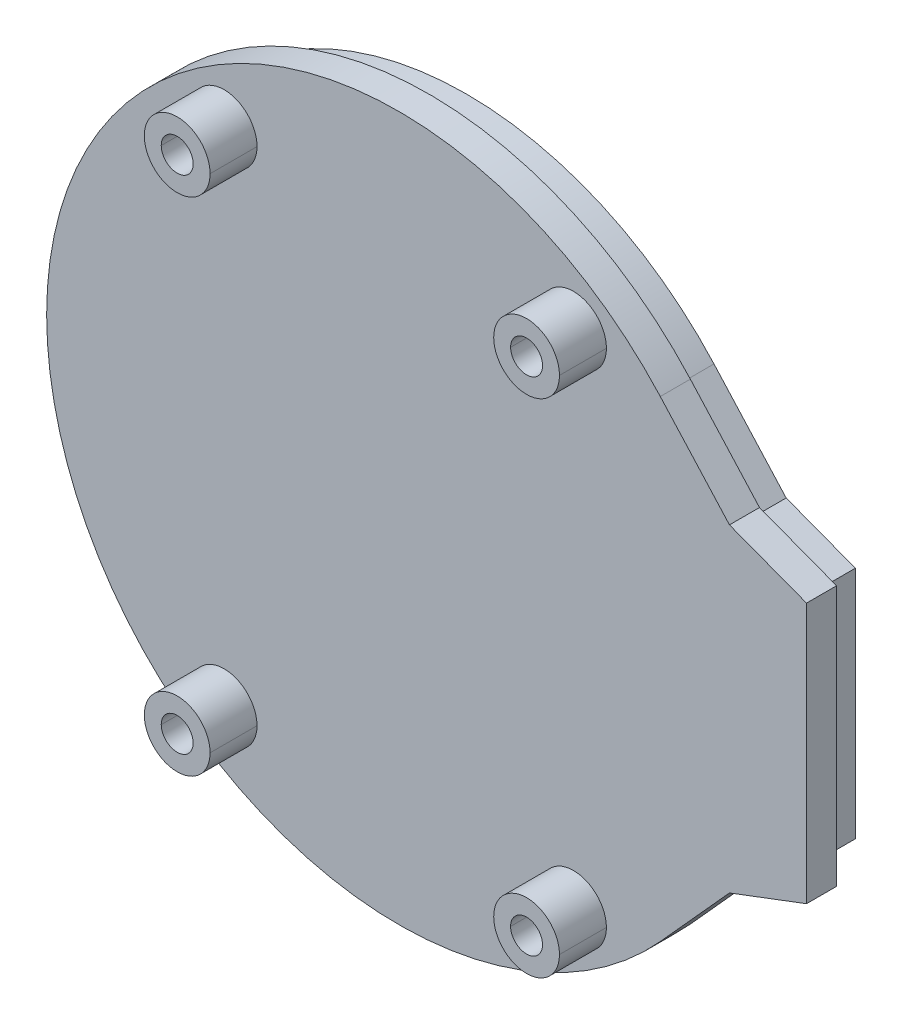
ISO-10303-21;
HEADER;
FILE_DESCRIPTION(('STEP AP214'),'2;1');
FILE_NAME('part.step','',(''),(''),'','','');
FILE_SCHEMA(('AUTOMOTIVE_DESIGN { 1 0 10303 214 1 1 1 1 }'));
ENDSEC;
DATA;
#1=APPLICATION_CONTEXT('core data for automotive mechanical design processes');
#2=APPLICATION_PROTOCOL_DEFINITION('international standard','automotive_design',2000,#1);
#3=PRODUCT_CONTEXT('',#1,'mechanical');
#4=PRODUCT('Part','Part','',(#3));
#5=PRODUCT_RELATED_PRODUCT_CATEGORY('part','',(#4));
#6=PRODUCT_DEFINITION_FORMATION('','',#4);
#7=PRODUCT_DEFINITION_CONTEXT('part definition',#1,'design');
#8=PRODUCT_DEFINITION('design','',#6,#7);
#9=PRODUCT_DEFINITION_SHAPE('','',#8);
#10=(LENGTH_UNIT() NAMED_UNIT(*) SI_UNIT(.MILLI.,.METRE.));
#11=(NAMED_UNIT(*) PLANE_ANGLE_UNIT() SI_UNIT($,.RADIAN.));
#12=(NAMED_UNIT(*) SI_UNIT($,.STERADIAN.) SOLID_ANGLE_UNIT());
#13=UNCERTAINTY_MEASURE_WITH_UNIT(LENGTH_MEASURE(1.E-05),#10,'distance_accuracy_value','');
#14=(GEOMETRIC_REPRESENTATION_CONTEXT(3) GLOBAL_UNCERTAINTY_ASSIGNED_CONTEXT((#13)) GLOBAL_UNIT_ASSIGNED_CONTEXT((#10,
#11,#12)) REPRESENTATION_CONTEXT('',''));
#15=CARTESIAN_POINT('',(0.,0.,0.));
#16=DIRECTION('',(0.,0.,1.));
#17=DIRECTION('',(1.,0.,0.));
#18=AXIS2_PLACEMENT_3D('',#15,#16,#17);
#19=CARTESIAN_POINT('',(13.91896407731,12.56283960793,-1.15));
#20=DIRECTION('',(0.742344750789687,0.670018112423088,0.));
#21=DIRECTION('',(0.,0.,-1.));
#22=AXIS2_PLACEMENT_3D('',#19,#20,#21);
#23=PLANE('',#22);
#24=DIRECTION('',(0.670018112423088,-0.742344750789687,0.));
#25=VECTOR('',#24,1.);
#26=CARTESIAN_POINT('',(13.91896407731,12.56283960793,0.45));
#27=LINE('',#26,#25);
#28=CARTESIAN_POINT('',(13.91896407731,12.56283960793,0.45));
#29=VERTEX_POINT('',#28);
#30=CARTESIAN_POINT('',(17.6,8.484445839148,0.45));
#31=VERTEX_POINT('',#30);
#32=EDGE_CURVE('E330',#29,#31,#27,.T.);
#33=ORIENTED_EDGE('',*,*,#32,.T.);
#34=DIRECTION('',(0.,0.,-1.));
#35=VECTOR('',#34,1.);
#36=CARTESIAN_POINT('',(17.6,8.484445839148,0.45));
#37=LINE('',#36,#35);
#38=CARTESIAN_POINT('',(17.6,8.484445839148,-1.15));
#39=VERTEX_POINT('',#38);
#40=EDGE_CURVE('E11',#31,#39,#37,.T.);
#41=ORIENTED_EDGE('',*,*,#40,.T.);
#42=DIRECTION('',(0.670018112423088,-0.742344750789687,0.));
#43=VECTOR('',#42,1.);
#44=CARTESIAN_POINT('',(13.91896407731,12.56283960793,-1.15));
#45=LINE('',#44,#43);
#46=CARTESIAN_POINT('',(13.91896407731,12.56283960793,-1.15));
#47=VERTEX_POINT('',#46);
#48=EDGE_CURVE('E390',#47,#39,#45,.T.);
#49=ORIENTED_EDGE('',*,*,#48,.F.);
#50=DIRECTION('',(0.,0.,1.));
#51=VECTOR('',#50,1.);
#52=CARTESIAN_POINT('',(13.91896407731,12.56283960793,-1.15));
#53=LINE('',#52,#51);
#54=EDGE_CURVE('E494',#47,#29,#53,.T.);
#55=ORIENTED_EDGE('',*,*,#54,.T.);
#56=EDGE_LOOP('',(#33,#41,#49,#55));
#57=FACE_BOUND('',#56,.T.);
#58=ADVANCED_FACE('F37',(#57),#23,.T.);
#59=CARTESIAN_POINT('',(16.50310576831,8.9,-1.15));
#60=DIRECTION('',(0.354274719657485,0.93514139198926,0.));
#61=DIRECTION('',(0.,0.,-1.));
#62=AXIS2_PLACEMENT_3D('',#59,#60,#61);
#63=PLANE('',#62);
#64=DIRECTION('',(0.93514139198926,-0.354274719657485,0.));
#65=VECTOR('',#64,1.);
#66=CARTESIAN_POINT('',(17.6,8.484445839148,0.45));
#67=LINE('',#66,#65);
#68=CARTESIAN_POINT('',(21.70310576831,6.93,0.45));
#69=VERTEX_POINT('',#68);
#70=EDGE_CURVE('E334',#31,#69,#67,.T.);
#71=ORIENTED_EDGE('',*,*,#70,.T.);
#72=DIRECTION('',(0.,0.,1.));
#73=VECTOR('',#72,1.);
#74=CARTESIAN_POINT('',(21.70310576831,6.93,-1.15));
#75=LINE('',#74,#73);
#76=CARTESIAN_POINT('',(21.70310576831,6.93,-1.15));
#77=VERTEX_POINT('',#76);
#78=EDGE_CURVE('E527',#77,#69,#75,.T.);
#79=ORIENTED_EDGE('',*,*,#78,.F.);
#80=DIRECTION('',(0.93514139198926,-0.354274719657485,0.));
#81=VECTOR('',#80,1.);
#82=CARTESIAN_POINT('',(17.6,8.484445839148,-1.15));
#83=LINE('',#82,#81);
#84=EDGE_CURVE('E392',#39,#77,#83,.T.);
#85=ORIENTED_EDGE('',*,*,#84,.F.);
#86=ORIENTED_EDGE('',*,*,#40,.F.);
#87=EDGE_LOOP('',(#71,#79,#85,#86));
#88=FACE_BOUND('',#87,.T.);
#89=ADVANCED_FACE('F653',(#88),#63,.T.);
#90=CARTESIAN_POINT('',(16.50310576831,-8.9,-1.15));
#91=DIRECTION('',(-0.354274719657485,0.93514139198926,0.));
#92=DIRECTION('',(0.,0.,1.));
#93=AXIS2_PLACEMENT_3D('',#90,#91,#92);
#94=PLANE('',#93);
#95=DIRECTION('',(0.93514139198926,0.354274719657485,0.));
#96=VECTOR('',#95,1.);
#97=CARTESIAN_POINT('',(17.6,-8.484445839148,-1.15));
#98=LINE('',#97,#96);
#99=CARTESIAN_POINT('',(17.6,-8.484445839148,-1.15));
#100=VERTEX_POINT('',#99);
#101=CARTESIAN_POINT('',(21.70310576831,-6.93,-1.15));
#102=VERTEX_POINT('',#101);
#103=EDGE_CURVE('E395',#100,#102,#98,.T.);
#104=ORIENTED_EDGE('',*,*,#103,.T.);
#105=DIRECTION('',(0.,0.,1.));
#106=VECTOR('',#105,1.);
#107=CARTESIAN_POINT('',(21.70310576831,-6.93,-1.15));
#108=LINE('',#107,#106);
#109=CARTESIAN_POINT('',(21.70310576831,-6.93,0.45));
#110=VERTEX_POINT('',#109);
#111=EDGE_CURVE('E391',#102,#110,#108,.T.);
#112=ORIENTED_EDGE('',*,*,#111,.T.);
#113=DIRECTION('',(0.93514139198926,0.354274719657485,0.));
#114=VECTOR('',#113,1.);
#115=CARTESIAN_POINT('',(17.6,-8.484445839148,0.45));
#116=LINE('',#115,#114);
#117=CARTESIAN_POINT('',(17.6,-8.484445839148,0.45));
#118=VERTEX_POINT('',#117);
#119=EDGE_CURVE('E410',#118,#110,#116,.T.);
#120=ORIENTED_EDGE('',*,*,#119,.F.);
#121=DIRECTION('',(0.,0.,-1.));
#122=VECTOR('',#121,1.);
#123=CARTESIAN_POINT('',(17.6,-8.484445839148,0.45));
#124=LINE('',#123,#122);
#125=EDGE_CURVE('E48',#118,#100,#124,.T.);
#126=ORIENTED_EDGE('',*,*,#125,.T.);
#127=EDGE_LOOP('',(#104,#112,#120,#126));
#128=FACE_BOUND('',#127,.T.);
#129=ADVANCED_FACE('F661',(#128),#94,.F.);
#130=CARTESIAN_POINT('',(13.91896407731,-12.56283960793,-1.15));
#131=DIRECTION('',(-0.742344750789687,0.670018112423088,0.));
#132=DIRECTION('',(0.,0.,1.));
#133=AXIS2_PLACEMENT_3D('',#130,#131,#132);
#134=PLANE('',#133);
#135=DIRECTION('',(0.670018112423088,0.742344750789687,0.));
#136=VECTOR('',#135,1.);
#137=CARTESIAN_POINT('',(13.91896407731,-12.56283960793,-1.15));
#138=LINE('',#137,#136);
#139=CARTESIAN_POINT('',(13.91896407731,-12.56283960793,-1.15));
#140=VERTEX_POINT('',#139);
#141=EDGE_CURVE('E434',#140,#100,#138,.T.);
#142=ORIENTED_EDGE('',*,*,#141,.T.);
#143=ORIENTED_EDGE('',*,*,#125,.F.);
#144=DIRECTION('',(0.670018112423088,0.742344750789687,0.));
#145=VECTOR('',#144,1.);
#146=CARTESIAN_POINT('',(13.91896407731,-12.56283960793,0.45));
#147=LINE('',#146,#145);
#148=CARTESIAN_POINT('',(13.91896407731,-12.56283960793,0.45));
#149=VERTEX_POINT('',#148);
#150=EDGE_CURVE('E333',#149,#118,#147,.T.);
#151=ORIENTED_EDGE('',*,*,#150,.F.);
#152=DIRECTION('',(0.,0.,1.));
#153=VECTOR('',#152,1.);
#154=CARTESIAN_POINT('',(13.91896407731,-12.56283960793,-1.15));
#155=LINE('',#154,#153);
#156=EDGE_CURVE('E324',#140,#149,#155,.T.);
#157=ORIENTED_EDGE('',*,*,#156,.F.);
#158=EDGE_LOOP('',(#142,#143,#151,#157));
#159=FACE_BOUND('',#158,.T.);
#160=ADVANCED_FACE('F663',(#159),#134,.F.);
#161=CARTESIAN_POINT('',(0.,-27.58782211759,-3.1));
#162=DIRECTION('',(0.,0.,-1.));
#163=DIRECTION('',(0.,-1.,0.));
#164=AXIS2_PLACEMENT_3D('',#161,#162,#163);
#165=PLANE('',#164);
#166=CARTESIAN_POINT('',(0.,0.,-3.1));
#167=DIRECTION('',(0.,0.,-1.));
#168=DIRECTION('',(0.,1.,0.));
#169=AXIS2_PLACEMENT_3D('',#166,#167,#168);
#170=CIRCLE('',#169,16.2);
#171=CARTESIAN_POINT('',(0.,16.2,-3.1));
#172=VERTEX_POINT('',#171);
#173=CARTESIAN_POINT('',(0.,-16.2,-3.1));
#174=VERTEX_POINT('',#173);
#175=EDGE_CURVE('E59',#172,#174,#170,.T.);
#176=ORIENTED_EDGE('',*,*,#175,.T.);
#177=CARTESIAN_POINT('',(0.,0.,-3.1));
#178=DIRECTION('',(0.,0.,-1.));
#179=DIRECTION('',(0.,-1.,0.));
#180=AXIS2_PLACEMENT_3D('',#177,#178,#179);
#181=CIRCLE('',#180,16.2);
#182=EDGE_CURVE('E535',#174,#172,#181,.T.);
#183=ORIENTED_EDGE('',*,*,#182,.T.);
#184=EDGE_LOOP('',(#176,#183));
#185=FACE_BOUND('',#184,.T.);
#186=ADVANCED_FACE('F706',(#185),#165,.T.);
#187=CARTESIAN_POINT('',(0.,0.,-3.15));
#188=DIRECTION('',(0.,0.,-1.));
#189=DIRECTION('',(0.,-1.,0.));
#190=AXIS2_PLACEMENT_3D('',#187,#188,#189);
#191=CYLINDRICAL_SURFACE('',#190,16.2);
#192=DIRECTION('',(0.,0.,1.));
#193=VECTOR('',#192,1.);
#194=CARTESIAN_POINT('',(0.,-16.2,-3.15));
#195=LINE('',#194,#193);
#196=CARTESIAN_POINT('',(0.,-16.2,-3.15));
#197=VERTEX_POINT('',#196);
#198=EDGE_CURVE('E41',#197,#174,#195,.T.);
#199=ORIENTED_EDGE('',*,*,#198,.T.);
#200=ORIENTED_EDGE('',*,*,#175,.F.);
#201=DIRECTION('',(0.,0.,1.));
#202=VECTOR('',#201,1.);
#203=CARTESIAN_POINT('',(0.,16.2,-3.15));
#204=LINE('',#203,#202);
#205=CARTESIAN_POINT('',(0.,16.2,-3.15));
#206=VERTEX_POINT('',#205);
#207=EDGE_CURVE('E538',#206,#172,#204,.T.);
#208=ORIENTED_EDGE('',*,*,#207,.F.);
#209=CARTESIAN_POINT('',(0.,0.,-3.15));
#210=DIRECTION('',(0.,0.,-1.));
#211=DIRECTION('',(0.,1.,0.));
#212=AXIS2_PLACEMENT_3D('',#209,#210,#211);
#213=CIRCLE('',#212,16.2);
#214=EDGE_CURVE('E460',#206,#197,#213,.T.);
#215=ORIENTED_EDGE('',*,*,#214,.T.);
#216=EDGE_LOOP('',(#199,#200,#208,#215));
#217=FACE_BOUND('',#216,.T.);
#218=ADVANCED_FACE('F713',(#217),#191,.F.);
#219=CARTESIAN_POINT('',(0.,0.,-3.15));
#220=DIRECTION('',(0.,0.,-1.));
#221=DIRECTION('',(0.,-1.,0.));
#222=AXIS2_PLACEMENT_3D('',#219,#220,#221);
#223=CYLINDRICAL_SURFACE('',#222,16.2);
#224=ORIENTED_EDGE('',*,*,#207,.T.);
#225=ORIENTED_EDGE('',*,*,#182,.F.);
#226=ORIENTED_EDGE('',*,*,#198,.F.);
#227=CARTESIAN_POINT('',(0.,0.,-3.15));
#228=DIRECTION('',(0.,0.,-1.));
#229=DIRECTION('',(0.,-1.,0.));
#230=AXIS2_PLACEMENT_3D('',#227,#228,#229);
#231=CIRCLE('',#230,16.2);
#232=EDGE_CURVE('E464',#197,#206,#231,.T.);
#233=ORIENTED_EDGE('',*,*,#232,.T.);
#234=EDGE_LOOP('',(#224,#225,#226,#233));
#235=FACE_BOUND('',#234,.T.);
#236=ADVANCED_FACE('F788',(#235),#223,.F.);
#237=CARTESIAN_POINT('',(17.01964161196,7.634955375374,-1.15));
#238=DIRECTION('',(0.354274719657485,0.93514139198926,0.));
#239=DIRECTION('',(0.,0.,-1.));
#240=AXIS2_PLACEMENT_3D('',#237,#238,#239);
#241=PLANE('',#240);
#242=DIRECTION('',(0.,0.,-1.));
#243=VECTOR('',#242,1.);
#244=CARTESIAN_POINT('',(20.70310576831,6.23948914691,-1.15));
#245=LINE('',#244,#243);
#246=CARTESIAN_POINT('',(20.70310576831,6.23948914691,-1.15));
#247=VERTEX_POINT('',#246);
#248=CARTESIAN_POINT('',(20.70310576831,6.23948914691,-3.15));
#249=VERTEX_POINT('',#248);
#250=EDGE_CURVE('E352',#247,#249,#245,.T.);
#251=ORIENTED_EDGE('',*,*,#250,.T.);
#252=DIRECTION('',(0.93514139198926,-0.354274719657485,0.));
#253=VECTOR('',#252,1.);
#254=CARTESIAN_POINT('',(17.01964161196,7.634955375374,-3.15));
#255=LINE('',#254,#253);
#256=CARTESIAN_POINT('',(17.01964161196,7.634955375374,-3.15));
#257=VERTEX_POINT('',#256);
#258=EDGE_CURVE('E351',#257,#249,#255,.T.);
#259=ORIENTED_EDGE('',*,*,#258,.F.);
#260=DIRECTION('',(0.,0.,-1.));
#261=VECTOR('',#260,1.);
#262=CARTESIAN_POINT('',(17.01964161196,7.634955375374,-1.15));
#263=LINE('',#262,#261);
#264=CARTESIAN_POINT('',(17.01964161196,7.634955375374,-1.15));
#265=VERTEX_POINT('',#264);
#266=EDGE_CURVE('E559',#265,#257,#263,.T.);
#267=ORIENTED_EDGE('',*,*,#266,.F.);
#268=DIRECTION('',(0.93514139198926,-0.354274719657485,0.));
#269=VECTOR('',#268,1.);
#270=CARTESIAN_POINT('',(17.01964161196,7.634955375374,-1.15));
#271=LINE('',#270,#269);
#272=EDGE_CURVE('E430',#265,#247,#271,.T.);
#273=ORIENTED_EDGE('',*,*,#272,.T.);
#274=EDGE_LOOP('',(#251,#259,#267,#273));
#275=FACE_BOUND('',#274,.T.);
#276=ADVANCED_FACE('F791',(#275),#241,.T.);
#277=CARTESIAN_POINT('',(13.17661932652,11.89282149551,-1.15));
#278=DIRECTION('',(0.742344750789687,0.670018112423088,0.));
#279=DIRECTION('',(0.,0.,-1.));
#280=AXIS2_PLACEMENT_3D('',#277,#278,#279);
#281=PLANE('',#280);
#282=ORIENTED_EDGE('',*,*,#266,.T.);
#283=DIRECTION('',(0.670018112423088,-0.742344750789687,0.));
#284=VECTOR('',#283,1.);
#285=CARTESIAN_POINT('',(13.17661932652,11.89282149551,-3.15));
#286=LINE('',#285,#284);
#287=CARTESIAN_POINT('',(13.17661932652,11.89282149551,-3.15));
#288=VERTEX_POINT('',#287);
#289=EDGE_CURVE('E345',#288,#257,#286,.T.);
#290=ORIENTED_EDGE('',*,*,#289,.F.);
#291=DIRECTION('',(0.,0.,-1.));
#292=VECTOR('',#291,1.);
#293=CARTESIAN_POINT('',(13.17661932652,11.89282149551,-1.15));
#294=LINE('',#293,#292);
#295=CARTESIAN_POINT('',(13.17661932652,11.89282149551,-1.15));
#296=VERTEX_POINT('',#295);
#297=EDGE_CURVE('E574',#296,#288,#294,.T.);
#298=ORIENTED_EDGE('',*,*,#297,.F.);
#299=DIRECTION('',(0.670018112423088,-0.742344750789687,0.));
#300=VECTOR('',#299,1.);
#301=CARTESIAN_POINT('',(13.17661932652,11.89282149551,-1.15));
#302=LINE('',#301,#300);
#303=EDGE_CURVE('E433',#296,#265,#302,.T.);
#304=ORIENTED_EDGE('',*,*,#303,.T.);
#305=EDGE_LOOP('',(#282,#290,#298,#304));
#306=FACE_BOUND('',#305,.T.);
#307=ADVANCED_FACE('F39',(#306),#281,.T.);
#308=CARTESIAN_POINT('',(17.01964161196,-7.634955375374,-1.15));
#309=DIRECTION('',(-0.354274719657485,0.93514139198926,0.));
#310=DIRECTION('',(0.,0.,1.));
#311=AXIS2_PLACEMENT_3D('',#308,#309,#310);
#312=PLANE('',#311);
#313=DIRECTION('',(0.,0.,-1.));
#314=VECTOR('',#313,1.);
#315=CARTESIAN_POINT('',(17.01964161196,-7.634955375374,-1.15));
#316=LINE('',#315,#314);
#317=CARTESIAN_POINT('',(17.01964161196,-7.634955375374,-1.15));
#318=VERTEX_POINT('',#317);
#319=CARTESIAN_POINT('',(17.01964161196,-7.634955375374,-3.15));
#320=VERTEX_POINT('',#319);
#321=EDGE_CURVE('E562',#318,#320,#316,.T.);
#322=ORIENTED_EDGE('',*,*,#321,.T.);
#323=DIRECTION('',(0.93514139198926,0.354274719657485,0.));
#324=VECTOR('',#323,1.);
#325=CARTESIAN_POINT('',(17.01964161196,-7.634955375374,-3.15));
#326=LINE('',#325,#324);
#327=CARTESIAN_POINT('',(20.70310576831,-6.23948914691,-3.15));
#328=VERTEX_POINT('',#327);
#329=EDGE_CURVE('E347',#320,#328,#326,.T.);
#330=ORIENTED_EDGE('',*,*,#329,.T.);
#331=DIRECTION('',(0.,0.,-1.));
#332=VECTOR('',#331,1.);
#333=CARTESIAN_POINT('',(20.70310576831,-6.23948914691,-1.15));
#334=LINE('',#333,#332);
#335=CARTESIAN_POINT('',(20.70310576831,-6.23948914691,-1.15));
#336=VERTEX_POINT('',#335);
#337=EDGE_CURVE('E346',#336,#328,#334,.T.);
#338=ORIENTED_EDGE('',*,*,#337,.F.);
#339=DIRECTION('',(0.93514139198926,0.354274719657485,0.));
#340=VECTOR('',#339,1.);
#341=CARTESIAN_POINT('',(17.01964161196,-7.634955375374,-1.15));
#342=LINE('',#341,#340);
#343=EDGE_CURVE('E335',#318,#336,#342,.T.);
#344=ORIENTED_EDGE('',*,*,#343,.F.);
#345=EDGE_LOOP('',(#322,#330,#338,#344));
#346=FACE_BOUND('',#345,.T.);
#347=ADVANCED_FACE('F812',(#346),#312,.F.);
#348=CARTESIAN_POINT('',(13.17661932652,-11.89282149551,-1.15));
#349=DIRECTION('',(-0.742344750789687,0.670018112423088,0.));
#350=DIRECTION('',(0.,0.,1.));
#351=AXIS2_PLACEMENT_3D('',#348,#349,#350);
#352=PLANE('',#351);
#353=DIRECTION('',(0.,0.,-1.));
#354=VECTOR('',#353,1.);
#355=CARTESIAN_POINT('',(13.17661932652,-11.89282149551,-1.15));
#356=LINE('',#355,#354);
#357=CARTESIAN_POINT('',(13.17661932652,-11.89282149551,-1.15));
#358=VERTEX_POINT('',#357);
#359=CARTESIAN_POINT('',(13.17661932652,-11.89282149551,-3.15));
#360=VERTEX_POINT('',#359);
#361=EDGE_CURVE('E580',#358,#360,#356,.T.);
#362=ORIENTED_EDGE('',*,*,#361,.T.);
#363=DIRECTION('',(0.670018112423088,0.742344750789687,0.));
#364=VECTOR('',#363,1.);
#365=CARTESIAN_POINT('',(13.17661932652,-11.89282149551,-3.15));
#366=LINE('',#365,#364);
#367=EDGE_CURVE('E350',#360,#320,#366,.T.);
#368=ORIENTED_EDGE('',*,*,#367,.T.);
#369=ORIENTED_EDGE('',*,*,#321,.F.);
#370=DIRECTION('',(0.670018112423088,0.742344750789687,0.));
#371=VECTOR('',#370,1.);
#372=CARTESIAN_POINT('',(13.17661932652,-11.89282149551,-1.15));
#373=LINE('',#372,#371);
#374=EDGE_CURVE('E340',#358,#318,#373,.T.);
#375=ORIENTED_EDGE('',*,*,#374,.F.);
#376=EDGE_LOOP('',(#362,#368,#369,#375));
#377=FACE_BOUND('',#376,.T.);
#378=ADVANCED_FACE('F724',(#377),#352,.F.);
#379=CARTESIAN_POINT('',(0.,0.,-1.15));
#380=DIRECTION('',(0.,0.,-1.));
#381=DIRECTION('',(-1.,0.,0.));
#382=AXIS2_PLACEMENT_3D('',#379,#380,#381);
#383=CYLINDRICAL_SURFACE('',#382,17.75);
#384=ORIENTED_EDGE('',*,*,#297,.T.);
#385=CARTESIAN_POINT('',(0.,0.,-3.15));
#386=DIRECTION('',(0.,0.,-1.));
#387=DIRECTION('',(0.742344750789687,-0.670018112423088,0.));
#388=AXIS2_PLACEMENT_3D('',#385,#386,#387);
#389=CIRCLE('',#388,17.75);
#390=EDGE_CURVE('E414',#360,#288,#389,.T.);
#391=ORIENTED_EDGE('',*,*,#390,.F.);
#392=ORIENTED_EDGE('',*,*,#361,.F.);
#393=CARTESIAN_POINT('',(0.,0.,-1.15));
#394=DIRECTION('',(0.,0.,1.));
#395=DIRECTION('',(0.742344750789687,0.670018112423088,0.));
#396=AXIS2_PLACEMENT_3D('',#393,#394,#395);
#397=CIRCLE('',#396,17.75);
#398=EDGE_CURVE('E480',#296,#358,#397,.T.);
#399=ORIENTED_EDGE('',*,*,#398,.F.);
#400=EDGE_LOOP('',(#384,#391,#392,#399));
#401=FACE_BOUND('',#400,.T.);
#402=ADVANCED_FACE('F720',(#401),#383,.T.);
#403=CARTESIAN_POINT('',(0.,-27.58782211759,-3.15));
#404=DIRECTION('',(0.,0.,-1.));
#405=DIRECTION('',(0.,-1.,0.));
#406=AXIS2_PLACEMENT_3D('',#403,#404,#405);
#407=PLANE('',#406);
#408=ORIENTED_EDGE('',*,*,#214,.F.);
#409=ORIENTED_EDGE('',*,*,#232,.F.);
#410=EDGE_LOOP('',(#408,#409));
#411=FACE_BOUND('',#410,.T.);
#412=ORIENTED_EDGE('',*,*,#289,.T.);
#413=ORIENTED_EDGE('',*,*,#258,.T.);
#414=DIRECTION('',(0.,-1.,0.));
#415=VECTOR('',#414,1.);
#416=CARTESIAN_POINT('',(20.70310576831,6.23948914691,-3.15));
#417=LINE('',#416,#415);
#418=EDGE_CURVE('E341',#249,#328,#417,.T.);
#419=ORIENTED_EDGE('',*,*,#418,.T.);
#420=ORIENTED_EDGE('',*,*,#329,.F.);
#421=ORIENTED_EDGE('',*,*,#367,.F.);
#422=ORIENTED_EDGE('',*,*,#390,.T.);
#423=EDGE_LOOP('',(#412,#413,#419,#420,#421,#422));
#424=FACE_BOUND('',#423,.T.);
#425=ADVANCED_FACE('F723',(#411,#424),#407,.T.);
#426=CARTESIAN_POINT('',(20.70310576831,6.23948914691,-1.15));
#427=DIRECTION('',(1.,0.,0.));
#428=DIRECTION('',(0.,1.,0.));
#429=AXIS2_PLACEMENT_3D('',#426,#427,#428);
#430=PLANE('',#429);
#431=ORIENTED_EDGE('',*,*,#250,.F.);
#432=DIRECTION('',(0.,1.,0.));
#433=VECTOR('',#432,1.);
#434=CARTESIAN_POINT('',(20.70310576831,-6.23948914691,-1.15));
#435=LINE('',#434,#433);
#436=EDGE_CURVE('E339',#336,#247,#435,.T.);
#437=ORIENTED_EDGE('',*,*,#436,.F.);
#438=ORIENTED_EDGE('',*,*,#337,.T.);
#439=ORIENTED_EDGE('',*,*,#418,.F.);
#440=EDGE_LOOP('',(#431,#437,#438,#439));
#441=FACE_BOUND('',#440,.T.);
#442=ADVANCED_FACE('F739',(#441),#430,.T.);
#443=CARTESIAN_POINT('',(25.45931385009,-27.58782211759,-1.15));
#444=DIRECTION('',(0.,0.,1.));
#445=DIRECTION('',(1.,0.,0.));
#446=AXIS2_PLACEMENT_3D('',#443,#444,#445);
#447=PLANE('',#446);
#448=ORIENTED_EDGE('',*,*,#272,.F.);
#449=ORIENTED_EDGE('',*,*,#303,.F.);
#450=ORIENTED_EDGE('',*,*,#398,.T.);
#451=ORIENTED_EDGE('',*,*,#374,.T.);
#452=ORIENTED_EDGE('',*,*,#343,.T.);
#453=ORIENTED_EDGE('',*,*,#436,.T.);
#454=EDGE_LOOP('',(#448,#449,#450,#451,#452,#453));
#455=FACE_BOUND('',#454,.T.);
#456=ORIENTED_EDGE('',*,*,#48,.T.);
#457=ORIENTED_EDGE('',*,*,#84,.T.);
#458=DIRECTION('',(0.,-1.,0.));
#459=VECTOR('',#458,1.);
#460=CARTESIAN_POINT('',(21.70310576831,6.93,-1.15));
#461=LINE('',#460,#459);
#462=EDGE_CURVE('E386',#77,#102,#461,.T.);
#463=ORIENTED_EDGE('',*,*,#462,.T.);
#464=ORIENTED_EDGE('',*,*,#103,.F.);
#465=ORIENTED_EDGE('',*,*,#141,.F.);
#466=CARTESIAN_POINT('',(0.,0.,-1.15));
#467=DIRECTION('',(0.,0.,1.));
#468=DIRECTION('',(0.742344750789687,0.670018112423088,0.));
#469=AXIS2_PLACEMENT_3D('',#466,#467,#468);
#470=CIRCLE('',#469,18.75);
#471=EDGE_CURVE('E498',#47,#140,#470,.T.);
#472=ORIENTED_EDGE('',*,*,#471,.F.);
#473=EDGE_LOOP('',(#456,#457,#463,#464,#465,#472));
#474=FACE_BOUND('',#473,.T.);
#475=ADVANCED_FACE('F643',(#455,#474),#447,.F.);
#476=CARTESIAN_POINT('',(21.70310576831,6.93,-1.15));
#477=DIRECTION('',(1.,0.,0.));
#478=DIRECTION('',(0.,1.,0.));
#479=AXIS2_PLACEMENT_3D('',#476,#477,#478);
#480=PLANE('',#479);
#481=ORIENTED_EDGE('',*,*,#78,.T.);
#482=DIRECTION('',(0.,1.,0.));
#483=VECTOR('',#482,1.);
#484=CARTESIAN_POINT('',(21.70310576831,-6.93,0.45));
#485=LINE('',#484,#483);
#486=EDGE_CURVE('E405',#110,#69,#485,.T.);
#487=ORIENTED_EDGE('',*,*,#486,.F.);
#488=ORIENTED_EDGE('',*,*,#111,.F.);
#489=ORIENTED_EDGE('',*,*,#462,.F.);
#490=EDGE_LOOP('',(#481,#487,#488,#489));
#491=FACE_BOUND('',#490,.T.);
#492=ADVANCED_FACE('F657',(#491),#480,.T.);
#493=CARTESIAN_POINT('',(9.3,13.35,0.45));
#494=DIRECTION('',(0.,0.,1.));
#495=DIRECTION('',(1.,0.,0.));
#496=AXIS2_PLACEMENT_3D('',#493,#494,#495);
#497=CYLINDRICAL_SURFACE('',#496,0.85);
#498=DIRECTION('',(0.,0.,1.));
#499=VECTOR('',#498,1.);
#500=CARTESIAN_POINT('',(10.15,13.35,0.45));
#501=LINE('',#500,#499);
#502=CARTESIAN_POINT('',(10.15,13.35,0.45));
#503=VERTEX_POINT('',#502);
#504=CARTESIAN_POINT('',(10.15,13.35,2.95));
#505=VERTEX_POINT('',#504);
#506=EDGE_CURVE('E530',#503,#505,#501,.T.);
#507=ORIENTED_EDGE('',*,*,#506,.T.);
#508=CARTESIAN_POINT('',(9.3,13.35,2.95));
#509=DIRECTION('',(0.,0.,-1.));
#510=DIRECTION('',(-1.,0.,0.));
#511=AXIS2_PLACEMENT_3D('',#508,#509,#510);
#512=CIRCLE('',#511,0.85);
#513=CARTESIAN_POINT('',(8.45,13.35,2.95));
#514=VERTEX_POINT('',#513);
#515=EDGE_CURVE('E361',#514,#505,#512,.T.);
#516=ORIENTED_EDGE('',*,*,#515,.F.);
#517=DIRECTION('',(0.,0.,1.));
#518=VECTOR('',#517,1.);
#519=CARTESIAN_POINT('',(8.45,13.35,0.45));
#520=LINE('',#519,#518);
#521=CARTESIAN_POINT('',(8.45,13.35,0.45));
#522=VERTEX_POINT('',#521);
#523=EDGE_CURVE('E420',#522,#514,#520,.T.);
#524=ORIENTED_EDGE('',*,*,#523,.F.);
#525=CARTESIAN_POINT('',(9.3,13.35,0.45));
#526=DIRECTION('',(0.,0.,1.));
#527=DIRECTION('',(1.,0.,0.));
#528=AXIS2_PLACEMENT_3D('',#525,#526,#527);
#529=CIRCLE('',#528,0.85);
#530=EDGE_CURVE('E425',#503,#522,#529,.T.);
#531=ORIENTED_EDGE('',*,*,#530,.F.);
#532=EDGE_LOOP('',(#507,#516,#524,#531));
#533=FACE_BOUND('',#532,.T.);
#534=ADVANCED_FACE('F697',(#533),#497,.F.);
#535=CARTESIAN_POINT('',(9.3,13.35,0.45));
#536=DIRECTION('',(0.,0.,1.));
#537=DIRECTION('',(1.,0.,0.));
#538=AXIS2_PLACEMENT_3D('',#535,#536,#537);
#539=CYLINDRICAL_SURFACE('',#538,0.85);
#540=ORIENTED_EDGE('',*,*,#523,.T.);
#541=CARTESIAN_POINT('',(9.3,13.35,2.95));
#542=DIRECTION('',(0.,0.,-1.));
#543=DIRECTION('',(1.,0.,0.));
#544=AXIS2_PLACEMENT_3D('',#541,#542,#543);
#545=CIRCLE('',#544,0.85);
#546=EDGE_CURVE('E356',#505,#514,#545,.T.);
#547=ORIENTED_EDGE('',*,*,#546,.F.);
#548=ORIENTED_EDGE('',*,*,#506,.F.);
#549=CARTESIAN_POINT('',(9.3,13.35,0.45));
#550=DIRECTION('',(0.,0.,1.));
#551=DIRECTION('',(-1.,0.,0.));
#552=AXIS2_PLACEMENT_3D('',#549,#550,#551);
#553=CIRCLE('',#552,0.85);
#554=EDGE_CURVE('E399',#522,#503,#553,.T.);
#555=ORIENTED_EDGE('',*,*,#554,.F.);
#556=EDGE_LOOP('',(#540,#547,#548,#555));
#557=FACE_BOUND('',#556,.T.);
#558=ADVANCED_FACE('F707',(#557),#539,.F.);
#559=CARTESIAN_POINT('',(9.3,13.35,0.45));
#560=DIRECTION('',(0.,0.,1.));
#561=DIRECTION('',(1.,0.,0.));
#562=AXIS2_PLACEMENT_3D('',#559,#560,#561);
#563=CYLINDRICAL_SURFACE('',#562,1.75);
#564=DIRECTION('',(0.,0.,1.));
#565=VECTOR('',#564,1.);
#566=CARTESIAN_POINT('',(11.05,13.35,0.45));
#567=LINE('',#566,#565);
#568=CARTESIAN_POINT('',(11.05,13.35,0.45));
#569=VERTEX_POINT('',#568);
#570=CARTESIAN_POINT('',(11.05,13.35,2.95));
#571=VERTEX_POINT('',#570);
#572=EDGE_CURVE('E417',#569,#571,#567,.T.);
#573=ORIENTED_EDGE('',*,*,#572,.T.);
#574=CARTESIAN_POINT('',(9.3,13.35,2.95));
#575=DIRECTION('',(0.,0.,1.));
#576=DIRECTION('',(-1.,0.,0.));
#577=AXIS2_PLACEMENT_3D('',#574,#575,#576);
#578=CIRCLE('',#577,1.75);
#579=CARTESIAN_POINT('',(7.55,13.35,2.95));
#580=VERTEX_POINT('',#579);
#581=EDGE_CURVE('E436',#580,#571,#578,.T.);
#582=ORIENTED_EDGE('',*,*,#581,.F.);
#583=DIRECTION('',(0.,0.,1.));
#584=VECTOR('',#583,1.);
#585=CARTESIAN_POINT('',(7.55,13.35,0.45));
#586=LINE('',#585,#584);
#587=CARTESIAN_POINT('',(7.55,13.35,0.45));
#588=VERTEX_POINT('',#587);
#589=EDGE_CURVE('E421',#588,#580,#586,.T.);
#590=ORIENTED_EDGE('',*,*,#589,.F.);
#591=CARTESIAN_POINT('',(9.3,13.35,0.45));
#592=DIRECTION('',(0.,0.,1.));
#593=DIRECTION('',(-1.,0.,0.));
#594=AXIS2_PLACEMENT_3D('',#591,#592,#593);
#595=CIRCLE('',#594,1.75);
#596=EDGE_CURVE('E372',#588,#569,#595,.T.);
#597=ORIENTED_EDGE('',*,*,#596,.T.);
#598=EDGE_LOOP('',(#573,#582,#590,#597));
#599=FACE_BOUND('',#598,.T.);
#600=ADVANCED_FACE('F702',(#599),#563,.T.);
#601=CARTESIAN_POINT('',(9.3,13.35,0.45));
#602=DIRECTION('',(0.,0.,1.));
#603=DIRECTION('',(1.,0.,0.));
#604=AXIS2_PLACEMENT_3D('',#601,#602,#603);
#605=CYLINDRICAL_SURFACE('',#604,1.75);
#606=ORIENTED_EDGE('',*,*,#589,.T.);
#607=CARTESIAN_POINT('',(9.3,13.35,2.95));
#608=DIRECTION('',(0.,0.,1.));
#609=DIRECTION('',(1.,0.,0.));
#610=AXIS2_PLACEMENT_3D('',#607,#608,#609);
#611=CIRCLE('',#610,1.75);
#612=EDGE_CURVE('E439',#571,#580,#611,.T.);
#613=ORIENTED_EDGE('',*,*,#612,.F.);
#614=ORIENTED_EDGE('',*,*,#572,.F.);
#615=CARTESIAN_POINT('',(9.3,13.35,0.45));
#616=DIRECTION('',(0.,0.,1.));
#617=DIRECTION('',(1.,0.,0.));
#618=AXIS2_PLACEMENT_3D('',#615,#616,#617);
#619=CIRCLE('',#618,1.75);
#620=EDGE_CURVE('E367',#569,#588,#619,.T.);
#621=ORIENTED_EDGE('',*,*,#620,.T.);
#622=EDGE_LOOP('',(#606,#613,#614,#621));
#623=FACE_BOUND('',#622,.T.);
#624=ADVANCED_FACE('F698',(#623),#605,.T.);
#625=CARTESIAN_POINT('',(-9.3,13.35,0.45));
#626=DIRECTION('',(0.,0.,1.));
#627=DIRECTION('',(1.,0.,0.));
#628=AXIS2_PLACEMENT_3D('',#625,#626,#627);
#629=CYLINDRICAL_SURFACE('',#628,0.85);
#630=DIRECTION('',(0.,0.,1.));
#631=VECTOR('',#630,1.);
#632=CARTESIAN_POINT('',(-8.45,13.35,0.45));
#633=LINE('',#632,#631);
#634=CARTESIAN_POINT('',(-8.45,13.35,0.45));
#635=VERTEX_POINT('',#634);
#636=CARTESIAN_POINT('',(-8.45,13.35,2.95));
#637=VERTEX_POINT('',#636);
#638=EDGE_CURVE('E467',#635,#637,#633,.T.);
#639=ORIENTED_EDGE('',*,*,#638,.T.);
#640=CARTESIAN_POINT('',(-9.3,13.35,2.95));
#641=DIRECTION('',(0.,0.,-1.));
#642=DIRECTION('',(-1.,0.,0.));
#643=AXIS2_PLACEMENT_3D('',#640,#641,#642);
#644=CIRCLE('',#643,0.85);
#645=CARTESIAN_POINT('',(-10.15,13.35,2.95));
#646=VERTEX_POINT('',#645);
#647=EDGE_CURVE('E365',#646,#637,#644,.T.);
#648=ORIENTED_EDGE('',*,*,#647,.F.);
#649=DIRECTION('',(0.,0.,1.));
#650=VECTOR('',#649,1.);
#651=CARTESIAN_POINT('',(-10.15,13.35,0.45));
#652=LINE('',#651,#650);
#653=CARTESIAN_POINT('',(-10.15,13.35,0.45));
#654=VERTEX_POINT('',#653);
#655=EDGE_CURVE('E360',#654,#646,#652,.T.);
#656=ORIENTED_EDGE('',*,*,#655,.F.);
#657=CARTESIAN_POINT('',(-9.3,13.35,0.45));
#658=DIRECTION('',(0.,0.,1.));
#659=DIRECTION('',(1.,0.,0.));
#660=AXIS2_PLACEMENT_3D('',#657,#658,#659);
#661=CIRCLE('',#660,0.85);
#662=EDGE_CURVE('E377',#635,#654,#661,.T.);
#663=ORIENTED_EDGE('',*,*,#662,.F.);
#664=EDGE_LOOP('',(#639,#648,#656,#663));
#665=FACE_BOUND('',#664,.T.);
#666=ADVANCED_FACE('F701',(#665),#629,.F.);
#667=CARTESIAN_POINT('',(-9.3,13.35,0.45));
#668=DIRECTION('',(0.,0.,1.));
#669=DIRECTION('',(1.,0.,0.));
#670=AXIS2_PLACEMENT_3D('',#667,#668,#669);
#671=CYLINDRICAL_SURFACE('',#670,0.85);
#672=ORIENTED_EDGE('',*,*,#655,.T.);
#673=CARTESIAN_POINT('',(-9.3,13.35,2.95));
#674=DIRECTION('',(0.,0.,-1.));
#675=DIRECTION('',(1.,0.,0.));
#676=AXIS2_PLACEMENT_3D('',#673,#674,#675);
#677=CIRCLE('',#676,0.85);
#678=EDGE_CURVE('E385',#637,#646,#677,.T.);
#679=ORIENTED_EDGE('',*,*,#678,.F.);
#680=ORIENTED_EDGE('',*,*,#638,.F.);
#681=CARTESIAN_POINT('',(-9.3,13.35,0.45));
#682=DIRECTION('',(0.,0.,1.));
#683=DIRECTION('',(-1.,0.,0.));
#684=AXIS2_PLACEMENT_3D('',#681,#682,#683);
#685=CIRCLE('',#684,0.85);
#686=EDGE_CURVE('E426',#654,#635,#685,.T.);
#687=ORIENTED_EDGE('',*,*,#686,.F.);
#688=EDGE_LOOP('',(#672,#679,#680,#687));
#689=FACE_BOUND('',#688,.T.);
#690=ADVANCED_FACE('F800',(#689),#671,.F.);
#691=CARTESIAN_POINT('',(0.,-27.58782211759,2.95));
#692=DIRECTION('',(0.,0.,1.));
#693=DIRECTION('',(1.,0.,0.));
#694=AXIS2_PLACEMENT_3D('',#691,#692,#693);
#695=PLANE('',#694);
#696=ORIENTED_EDGE('',*,*,#515,.T.);
#697=ORIENTED_EDGE('',*,*,#546,.T.);
#698=EDGE_LOOP('',(#696,#697));
#699=FACE_BOUND('',#698,.T.);
#700=ORIENTED_EDGE('',*,*,#581,.T.);
#701=ORIENTED_EDGE('',*,*,#612,.T.);
#702=EDGE_LOOP('',(#700,#701));
#703=FACE_BOUND('',#702,.T.);
#704=ADVANCED_FACE('F718',(#699,#703),#695,.T.);
#705=CARTESIAN_POINT('',(0.,-27.58782211759,2.95));
#706=DIRECTION('',(0.,0.,1.));
#707=DIRECTION('',(1.,0.,0.));
#708=AXIS2_PLACEMENT_3D('',#705,#706,#707);
#709=PLANE('',#708);
#710=ORIENTED_EDGE('',*,*,#647,.T.);
#711=ORIENTED_EDGE('',*,*,#678,.T.);
#712=EDGE_LOOP('',(#710,#711));
#713=FACE_BOUND('',#712,.T.);
#714=CARTESIAN_POINT('',(-9.3,13.35,2.95));
#715=DIRECTION('',(0.,0.,1.));
#716=DIRECTION('',(-1.,0.,0.));
#717=AXIS2_PLACEMENT_3D('',#714,#715,#716);
#718=CIRCLE('',#717,1.75);
#719=CARTESIAN_POINT('',(-11.05,13.35,2.95));
#720=VERTEX_POINT('',#719);
#721=CARTESIAN_POINT('',(-7.55,13.35,2.95));
#722=VERTEX_POINT('',#721);
#723=EDGE_CURVE('E362',#720,#722,#718,.T.);
#724=ORIENTED_EDGE('',*,*,#723,.T.);
#725=CARTESIAN_POINT('',(-9.3,13.35,2.95));
#726=DIRECTION('',(0.,0.,1.));
#727=DIRECTION('',(1.,0.,0.));
#728=AXIS2_PLACEMENT_3D('',#725,#726,#727);
#729=CIRCLE('',#728,1.75);
#730=EDGE_CURVE('E442',#722,#720,#729,.T.);
#731=ORIENTED_EDGE('',*,*,#730,.T.);
#732=EDGE_LOOP('',(#724,#731));
#733=FACE_BOUND('',#732,.T.);
#734=ADVANCED_FACE('F714',(#713,#733),#709,.T.);
#735=CARTESIAN_POINT('',(-9.3,13.35,0.45));
#736=DIRECTION('',(0.,0.,1.));
#737=DIRECTION('',(1.,0.,0.));
#738=AXIS2_PLACEMENT_3D('',#735,#736,#737);
#739=CYLINDRICAL_SURFACE('',#738,1.75);
#740=DIRECTION('',(0.,0.,1.));
#741=VECTOR('',#740,1.);
#742=CARTESIAN_POINT('',(-7.55,13.35,0.45));
#743=LINE('',#742,#741);
#744=CARTESIAN_POINT('',(-7.55,13.35,0.45));
#745=VERTEX_POINT('',#744);
#746=EDGE_CURVE('E366',#745,#722,#743,.T.);
#747=ORIENTED_EDGE('',*,*,#746,.T.);
#748=ORIENTED_EDGE('',*,*,#723,.F.);
#749=DIRECTION('',(0.,0.,1.));
#750=VECTOR('',#749,1.);
#751=CARTESIAN_POINT('',(-11.05,13.35,0.45));
#752=LINE('',#751,#750);
#753=CARTESIAN_POINT('',(-11.05,13.35,0.45));
#754=VERTEX_POINT('',#753);
#755=EDGE_CURVE('E328',#754,#720,#752,.T.);
#756=ORIENTED_EDGE('',*,*,#755,.F.);
#757=CARTESIAN_POINT('',(-9.3,13.35,0.45));
#758=DIRECTION('',(0.,0.,1.));
#759=DIRECTION('',(-1.,0.,0.));
#760=AXIS2_PLACEMENT_3D('',#757,#758,#759);
#761=CIRCLE('',#760,1.75);
#762=EDGE_CURVE('E490',#754,#745,#761,.T.);
#763=ORIENTED_EDGE('',*,*,#762,.T.);
#764=EDGE_LOOP('',(#747,#748,#756,#763));
#765=FACE_BOUND('',#764,.T.);
#766=ADVANCED_FACE('F717',(#765),#739,.T.);
#767=CARTESIAN_POINT('',(-9.3,13.35,0.45));
#768=DIRECTION('',(0.,0.,1.));
#769=DIRECTION('',(1.,0.,0.));
#770=AXIS2_PLACEMENT_3D('',#767,#768,#769);
#771=CYLINDRICAL_SURFACE('',#770,1.75);
#772=ORIENTED_EDGE('',*,*,#755,.T.);
#773=ORIENTED_EDGE('',*,*,#730,.F.);
#774=ORIENTED_EDGE('',*,*,#746,.F.);
#775=CARTESIAN_POINT('',(-9.3,13.35,0.45));
#776=DIRECTION('',(0.,0.,1.));
#777=DIRECTION('',(1.,0.,0.));
#778=AXIS2_PLACEMENT_3D('',#775,#776,#777);
#779=CIRCLE('',#778,1.75);
#780=EDGE_CURVE('E486',#745,#754,#779,.T.);
#781=ORIENTED_EDGE('',*,*,#780,.T.);
#782=EDGE_LOOP('',(#772,#773,#774,#781));
#783=FACE_BOUND('',#782,.T.);
#784=ADVANCED_FACE('F778',(#783),#771,.T.);
#785=CARTESIAN_POINT('',(9.3,-13.35,0.45));
#786=DIRECTION('',(0.,0.,-1.));
#787=DIRECTION('',(1.,0.,0.));
#788=AXIS2_PLACEMENT_3D('',#785,#786,#787);
#789=CYLINDRICAL_SURFACE('',#788,0.85);
#790=DIRECTION('',(0.,0.,1.));
#791=VECTOR('',#790,1.);
#792=CARTESIAN_POINT('',(8.45,-13.35,0.45));
#793=LINE('',#792,#791);
#794=CARTESIAN_POINT('',(8.45,-13.35,0.45));
#795=VERTEX_POINT('',#794);
#796=CARTESIAN_POINT('',(8.45,-13.35,2.95));
#797=VERTEX_POINT('',#796);
#798=EDGE_CURVE('E305',#795,#797,#793,.T.);
#799=ORIENTED_EDGE('',*,*,#798,.T.);
#800=CARTESIAN_POINT('',(9.3,-13.35,2.95));
#801=DIRECTION('',(0.,0.,1.));
#802=DIRECTION('',(-1.,0.,0.));
#803=AXIS2_PLACEMENT_3D('',#800,#801,#802);
#804=CIRCLE('',#803,0.85);
#805=CARTESIAN_POINT('',(10.15,-13.35,2.95));
#806=VERTEX_POINT('',#805);
#807=EDGE_CURVE('E300',#797,#806,#804,.T.);
#808=ORIENTED_EDGE('',*,*,#807,.T.);
#809=DIRECTION('',(0.,0.,1.));
#810=VECTOR('',#809,1.);
#811=CARTESIAN_POINT('',(10.15,-13.35,0.45));
#812=LINE('',#811,#810);
#813=CARTESIAN_POINT('',(10.15,-13.35,0.45));
#814=VERTEX_POINT('',#813);
#815=EDGE_CURVE('E294',#814,#806,#812,.T.);
#816=ORIENTED_EDGE('',*,*,#815,.F.);
#817=CARTESIAN_POINT('',(9.3,-13.35,0.45));
#818=DIRECTION('',(0.,0.,-1.));
#819=DIRECTION('',(1.,0.,0.));
#820=AXIS2_PLACEMENT_3D('',#817,#818,#819);
#821=CIRCLE('',#820,0.85);
#822=EDGE_CURVE('E298',#814,#795,#821,.T.);
#823=ORIENTED_EDGE('',*,*,#822,.T.);
#824=EDGE_LOOP('',(#799,#808,#816,#823));
#825=FACE_BOUND('',#824,.T.);
#826=ADVANCED_FACE('F296',(#825),#789,.F.);
#827=CARTESIAN_POINT('',(9.3,-13.35,0.45));
#828=DIRECTION('',(0.,0.,-1.));
#829=DIRECTION('',(1.,0.,0.));
#830=AXIS2_PLACEMENT_3D('',#827,#828,#829);
#831=CYLINDRICAL_SURFACE('',#830,0.85);
#832=ORIENTED_EDGE('',*,*,#815,.T.);
#833=CARTESIAN_POINT('',(9.3,-13.35,2.95));
#834=DIRECTION('',(0.,0.,1.));
#835=DIRECTION('',(1.,0.,0.));
#836=AXIS2_PLACEMENT_3D('',#833,#834,#835);
#837=CIRCLE('',#836,0.85);
#838=EDGE_CURVE('E479',#806,#797,#837,.T.);
#839=ORIENTED_EDGE('',*,*,#838,.T.);
#840=ORIENTED_EDGE('',*,*,#798,.F.);
#841=CARTESIAN_POINT('',(9.3,-13.35,0.45));
#842=DIRECTION('',(0.,0.,-1.));
#843=DIRECTION('',(-1.,0.,0.));
#844=AXIS2_PLACEMENT_3D('',#841,#842,#843);
#845=CIRCLE('',#844,0.85);
#846=EDGE_CURVE('E309',#795,#814,#845,.T.);
#847=ORIENTED_EDGE('',*,*,#846,.T.);
#848=EDGE_LOOP('',(#832,#839,#840,#847));
#849=FACE_BOUND('',#848,.T.);
#850=ADVANCED_FACE('F310',(#849),#831,.F.);
#851=CARTESIAN_POINT('',(-9.3,-13.35,0.45));
#852=DIRECTION('',(0.,0.,-1.));
#853=DIRECTION('',(1.,0.,0.));
#854=AXIS2_PLACEMENT_3D('',#851,#852,#853);
#855=CYLINDRICAL_SURFACE('',#854,0.85);
#856=DIRECTION('',(0.,0.,1.));
#857=VECTOR('',#856,1.);
#858=CARTESIAN_POINT('',(-10.15,-13.35,0.45));
#859=LINE('',#858,#857);
#860=CARTESIAN_POINT('',(-10.15,-13.35,0.45));
#861=VERTEX_POINT('',#860);
#862=CARTESIAN_POINT('',(-10.15,-13.35,2.95));
#863=VERTEX_POINT('',#862);
#864=EDGE_CURVE('E306',#861,#863,#859,.T.);
#865=ORIENTED_EDGE('',*,*,#864,.T.);
#866=CARTESIAN_POINT('',(-9.3,-13.35,2.95));
#867=DIRECTION('',(0.,0.,1.));
#868=DIRECTION('',(-1.,0.,0.));
#869=AXIS2_PLACEMENT_3D('',#866,#867,#868);
#870=CIRCLE('',#869,0.85);
#871=CARTESIAN_POINT('',(-8.45,-13.35,2.95));
#872=VERTEX_POINT('',#871);
#873=EDGE_CURVE('E471',#863,#872,#870,.T.);
#874=ORIENTED_EDGE('',*,*,#873,.T.);
#875=DIRECTION('',(0.,0.,1.));
#876=VECTOR('',#875,1.);
#877=CARTESIAN_POINT('',(-8.45,-13.35,0.45));
#878=LINE('',#877,#876);
#879=CARTESIAN_POINT('',(-8.45,-13.35,0.45));
#880=VERTEX_POINT('',#879);
#881=EDGE_CURVE('E378',#880,#872,#878,.T.);
#882=ORIENTED_EDGE('',*,*,#881,.F.);
#883=CARTESIAN_POINT('',(-9.3,-13.35,0.45));
#884=DIRECTION('',(0.,0.,-1.));
#885=DIRECTION('',(1.,0.,0.));
#886=AXIS2_PLACEMENT_3D('',#883,#884,#885);
#887=CIRCLE('',#886,0.85);
#888=EDGE_CURVE('E313',#880,#861,#887,.T.);
#889=ORIENTED_EDGE('',*,*,#888,.T.);
#890=EDGE_LOOP('',(#865,#874,#882,#889));
#891=FACE_BOUND('',#890,.T.);
#892=ADVANCED_FACE('F749',(#891),#855,.F.);
#893=CARTESIAN_POINT('',(-9.3,-13.35,0.45));
#894=DIRECTION('',(0.,0.,-1.));
#895=DIRECTION('',(1.,0.,0.));
#896=AXIS2_PLACEMENT_3D('',#893,#894,#895);
#897=CYLINDRICAL_SURFACE('',#896,0.85);
#898=ORIENTED_EDGE('',*,*,#881,.T.);
#899=CARTESIAN_POINT('',(-9.3,-13.35,2.95));
#900=DIRECTION('',(0.,0.,1.));
#901=DIRECTION('',(1.,0.,0.));
#902=AXIS2_PLACEMENT_3D('',#899,#900,#901);
#903=CIRCLE('',#902,0.85);
#904=EDGE_CURVE('E474',#872,#863,#903,.T.);
#905=ORIENTED_EDGE('',*,*,#904,.T.);
#906=ORIENTED_EDGE('',*,*,#864,.F.);
#907=CARTESIAN_POINT('',(-9.3,-13.35,0.45));
#908=DIRECTION('',(0.,0.,-1.));
#909=DIRECTION('',(-1.,0.,0.));
#910=AXIS2_PLACEMENT_3D('',#907,#908,#909);
#911=CIRCLE('',#910,0.85);
#912=EDGE_CURVE('E373',#861,#880,#911,.T.);
#913=ORIENTED_EDGE('',*,*,#912,.T.);
#914=EDGE_LOOP('',(#898,#905,#906,#913));
#915=FACE_BOUND('',#914,.T.);
#916=ADVANCED_FACE('F746',(#915),#897,.F.);
#917=CARTESIAN_POINT('',(-9.3,-13.35,0.45));
#918=DIRECTION('',(0.,0.,-1.));
#919=DIRECTION('',(1.,0.,0.));
#920=AXIS2_PLACEMENT_3D('',#917,#918,#919);
#921=CYLINDRICAL_SURFACE('',#920,1.75);
#922=DIRECTION('',(0.,0.,1.));
#923=VECTOR('',#922,1.);
#924=CARTESIAN_POINT('',(-11.05,-13.35,0.45));
#925=LINE('',#924,#923);
#926=CARTESIAN_POINT('',(-11.05,-13.35,0.45));
#927=VERTEX_POINT('',#926);
#928=CARTESIAN_POINT('',(-11.05,-13.35,2.95));
#929=VERTEX_POINT('',#928);
#930=EDGE_CURVE('E381',#927,#929,#925,.T.);
#931=ORIENTED_EDGE('',*,*,#930,.T.);
#932=CARTESIAN_POINT('',(-9.3,-13.35,2.95));
#933=DIRECTION('',(0.,0.,-1.));
#934=DIRECTION('',(-1.,0.,0.));
#935=AXIS2_PLACEMENT_3D('',#932,#933,#934);
#936=CIRCLE('',#935,1.75);
#937=CARTESIAN_POINT('',(-7.55,-13.35,2.95));
#938=VERTEX_POINT('',#937);
#939=EDGE_CURVE('E403',#929,#938,#936,.T.);
#940=ORIENTED_EDGE('',*,*,#939,.T.);
#941=DIRECTION('',(0.,0.,1.));
#942=VECTOR('',#941,1.);
#943=CARTESIAN_POINT('',(-7.55,-13.35,0.45));
#944=LINE('',#943,#942);
#945=CARTESIAN_POINT('',(-7.55,-13.35,0.45));
#946=VERTEX_POINT('',#945);
#947=EDGE_CURVE('E504',#946,#938,#944,.T.);
#948=ORIENTED_EDGE('',*,*,#947,.F.);
#949=CARTESIAN_POINT('',(-9.3,-13.35,0.45));
#950=DIRECTION('',(0.,0.,-1.));
#951=DIRECTION('',(-1.,0.,0.));
#952=AXIS2_PLACEMENT_3D('',#949,#950,#951);
#953=CIRCLE('',#952,1.75);
#954=EDGE_CURVE('E558',#927,#946,#953,.T.);
#955=ORIENTED_EDGE('',*,*,#954,.F.);
#956=EDGE_LOOP('',(#931,#940,#948,#955));
#957=FACE_BOUND('',#956,.T.);
#958=ADVANCED_FACE('F748',(#957),#921,.T.);
#959=CARTESIAN_POINT('',(-9.3,-13.35,0.45));
#960=DIRECTION('',(0.,0.,-1.));
#961=DIRECTION('',(1.,0.,0.));
#962=AXIS2_PLACEMENT_3D('',#959,#960,#961);
#963=CYLINDRICAL_SURFACE('',#962,1.75);
#964=ORIENTED_EDGE('',*,*,#947,.T.);
#965=CARTESIAN_POINT('',(-9.3,-13.35,2.95));
#966=DIRECTION('',(0.,0.,-1.));
#967=DIRECTION('',(1.,0.,0.));
#968=AXIS2_PLACEMENT_3D('',#965,#966,#967);
#969=CIRCLE('',#968,1.75);
#970=EDGE_CURVE('E475',#938,#929,#969,.T.);
#971=ORIENTED_EDGE('',*,*,#970,.T.);
#972=ORIENTED_EDGE('',*,*,#930,.F.);
#973=CARTESIAN_POINT('',(-9.3,-13.35,0.45));
#974=DIRECTION('',(0.,0.,-1.));
#975=DIRECTION('',(1.,0.,0.));
#976=AXIS2_PLACEMENT_3D('',#973,#974,#975);
#977=CIRCLE('',#976,1.75);
#978=EDGE_CURVE('E501',#946,#927,#977,.T.);
#979=ORIENTED_EDGE('',*,*,#978,.F.);
#980=EDGE_LOOP('',(#964,#971,#972,#979));
#981=FACE_BOUND('',#980,.T.);
#982=ADVANCED_FACE('F755',(#981),#963,.T.);
#983=CARTESIAN_POINT('',(0.,27.58782211759,2.95));
#984=DIRECTION('',(0.,0.,-1.));
#985=DIRECTION('',(0.,-1.,0.));
#986=AXIS2_PLACEMENT_3D('',#983,#984,#985);
#987=PLANE('',#986);
#988=ORIENTED_EDGE('',*,*,#807,.F.);
#989=ORIENTED_EDGE('',*,*,#838,.F.);
#990=EDGE_LOOP('',(#988,#989));
#991=FACE_BOUND('',#990,.T.);
#992=CARTESIAN_POINT('',(9.3,-13.35,2.95));
#993=DIRECTION('',(0.,0.,-1.));
#994=DIRECTION('',(-1.,0.,0.));
#995=AXIS2_PLACEMENT_3D('',#992,#993,#994);
#996=CIRCLE('',#995,1.75);
#997=CARTESIAN_POINT('',(7.55,-13.35,2.95));
#998=VERTEX_POINT('',#997);
#999=CARTESIAN_POINT('',(11.05,-13.35,2.95));
#1000=VERTEX_POINT('',#999);
#1001=EDGE_CURVE('E400',#998,#1000,#996,.T.);
#1002=ORIENTED_EDGE('',*,*,#1001,.F.);
#1003=CARTESIAN_POINT('',(9.3,-13.35,2.95));
#1004=DIRECTION('',(0.,0.,-1.));
#1005=DIRECTION('',(1.,0.,0.));
#1006=AXIS2_PLACEMENT_3D('',#1003,#1004,#1005);
#1007=CIRCLE('',#1006,1.75);
#1008=EDGE_CURVE('E531',#1000,#998,#1007,.T.);
#1009=ORIENTED_EDGE('',*,*,#1008,.F.);
#1010=EDGE_LOOP('',(#1002,#1009));
#1011=FACE_BOUND('',#1010,.T.);
#1012=ADVANCED_FACE('F729',(#991,#1011),#987,.F.);
#1013=CARTESIAN_POINT('',(0.,27.58782211759,2.95));
#1014=DIRECTION('',(0.,0.,-1.));
#1015=DIRECTION('',(0.,-1.,0.));
#1016=AXIS2_PLACEMENT_3D('',#1013,#1014,#1015);
#1017=PLANE('',#1016);
#1018=ORIENTED_EDGE('',*,*,#873,.F.);
#1019=ORIENTED_EDGE('',*,*,#904,.F.);
#1020=EDGE_LOOP('',(#1018,#1019));
#1021=FACE_BOUND('',#1020,.T.);
#1022=ORIENTED_EDGE('',*,*,#939,.F.);
#1023=ORIENTED_EDGE('',*,*,#970,.F.);
#1024=EDGE_LOOP('',(#1022,#1023));
#1025=FACE_BOUND('',#1024,.T.);
#1026=ADVANCED_FACE('F726',(#1021,#1025),#1017,.F.);
#1027=CARTESIAN_POINT('',(9.3,-13.35,0.45));
#1028=DIRECTION('',(0.,0.,-1.));
#1029=DIRECTION('',(1.,0.,0.));
#1030=AXIS2_PLACEMENT_3D('',#1027,#1028,#1029);
#1031=CYLINDRICAL_SURFACE('',#1030,1.75);
#1032=DIRECTION('',(0.,0.,1.));
#1033=VECTOR('',#1032,1.);
#1034=CARTESIAN_POINT('',(7.55,-13.35,0.45));
#1035=LINE('',#1034,#1033);
#1036=CARTESIAN_POINT('',(7.55,-13.35,0.45));
#1037=VERTEX_POINT('',#1036);
#1038=EDGE_CURVE('E404',#1037,#998,#1035,.T.);
#1039=ORIENTED_EDGE('',*,*,#1038,.T.);
#1040=ORIENTED_EDGE('',*,*,#1001,.T.);
#1041=DIRECTION('',(0.,0.,1.));
#1042=VECTOR('',#1041,1.);
#1043=CARTESIAN_POINT('',(11.05,-13.35,0.45));
#1044=LINE('',#1043,#1042);
#1045=CARTESIAN_POINT('',(11.05,-13.35,0.45));
#1046=VERTEX_POINT('',#1045);
#1047=EDGE_CURVE('E371',#1046,#1000,#1044,.T.);
#1048=ORIENTED_EDGE('',*,*,#1047,.F.);
#1049=CARTESIAN_POINT('',(9.3,-13.35,0.45));
#1050=DIRECTION('',(0.,0.,-1.));
#1051=DIRECTION('',(-1.,0.,0.));
#1052=AXIS2_PLACEMENT_3D('',#1049,#1050,#1051);
#1053=CIRCLE('',#1052,1.75);
#1054=EDGE_CURVE('E409',#1037,#1046,#1053,.T.);
#1055=ORIENTED_EDGE('',*,*,#1054,.F.);
#1056=EDGE_LOOP('',(#1039,#1040,#1048,#1055));
#1057=FACE_BOUND('',#1056,.T.);
#1058=ADVANCED_FACE('F679',(#1057),#1031,.T.);
#1059=CARTESIAN_POINT('',(9.3,-13.35,0.45));
#1060=DIRECTION('',(0.,0.,-1.));
#1061=DIRECTION('',(1.,0.,0.));
#1062=AXIS2_PLACEMENT_3D('',#1059,#1060,#1061);
#1063=CYLINDRICAL_SURFACE('',#1062,1.75);
#1064=ORIENTED_EDGE('',*,*,#1047,.T.);
#1065=ORIENTED_EDGE('',*,*,#1008,.T.);
#1066=ORIENTED_EDGE('',*,*,#1038,.F.);
#1067=CARTESIAN_POINT('',(9.3,-13.35,0.45));
#1068=DIRECTION('',(0.,0.,-1.));
#1069=DIRECTION('',(1.,0.,0.));
#1070=AXIS2_PLACEMENT_3D('',#1067,#1068,#1069);
#1071=CIRCLE('',#1070,1.75);
#1072=EDGE_CURVE('E459',#1046,#1037,#1071,.T.);
#1073=ORIENTED_EDGE('',*,*,#1072,.F.);
#1074=EDGE_LOOP('',(#1064,#1065,#1066,#1073));
#1075=FACE_BOUND('',#1074,.T.);
#1076=ADVANCED_FACE('F669',(#1075),#1063,.T.);
#1077=CARTESIAN_POINT('',(-21.31999347877,-27.58782211759,0.45));
#1078=DIRECTION('',(0.,0.,-1.));
#1079=DIRECTION('',(0.,-1.,0.));
#1080=AXIS2_PLACEMENT_3D('',#1077,#1078,#1079);
#1081=PLANE('',#1080);
#1082=ORIENTED_EDGE('',*,*,#596,.F.);
#1083=ORIENTED_EDGE('',*,*,#620,.F.);
#1084=EDGE_LOOP('',(#1082,#1083));
#1085=FACE_BOUND('',#1084,.T.);
#1086=ORIENTED_EDGE('',*,*,#762,.F.);
#1087=ORIENTED_EDGE('',*,*,#780,.F.);
#1088=EDGE_LOOP('',(#1086,#1087));
#1089=FACE_BOUND('',#1088,.T.);
#1090=ORIENTED_EDGE('',*,*,#954,.T.);
#1091=ORIENTED_EDGE('',*,*,#978,.T.);
#1092=EDGE_LOOP('',(#1090,#1091));
#1093=FACE_BOUND('',#1092,.T.);
#1094=ORIENTED_EDGE('',*,*,#1054,.T.);
#1095=ORIENTED_EDGE('',*,*,#1072,.T.);
#1096=EDGE_LOOP('',(#1094,#1095));
#1097=FACE_BOUND('',#1096,.T.);
#1098=ORIENTED_EDGE('',*,*,#70,.F.);
#1099=ORIENTED_EDGE('',*,*,#32,.F.);
#1100=CARTESIAN_POINT('',(0.,0.,0.45));
#1101=DIRECTION('',(0.,0.,-1.));
#1102=DIRECTION('',(0.742344750789687,-0.670018112423088,0.));
#1103=AXIS2_PLACEMENT_3D('',#1100,#1101,#1102);
#1104=CIRCLE('',#1103,18.75);
#1105=EDGE_CURVE('E317',#149,#29,#1104,.T.);
#1106=ORIENTED_EDGE('',*,*,#1105,.F.);
#1107=ORIENTED_EDGE('',*,*,#150,.T.);
#1108=ORIENTED_EDGE('',*,*,#119,.T.);
#1109=ORIENTED_EDGE('',*,*,#486,.T.);
#1110=EDGE_LOOP('',(#1098,#1099,#1106,#1107,#1108,#1109));
#1111=FACE_BOUND('',#1110,.T.);
#1112=ADVANCED_FACE('F666',(#1085,#1089,#1093,#1097,#1111),#1081,.F.);
#1113=CARTESIAN_POINT('',(-21.31999347877,-27.58782211759,0.45));
#1114=DIRECTION('',(0.,0.,-1.));
#1115=DIRECTION('',(0.,-1.,0.));
#1116=AXIS2_PLACEMENT_3D('',#1113,#1114,#1115);
#1117=PLANE('',#1116);
#1118=ORIENTED_EDGE('',*,*,#530,.T.);
#1119=ORIENTED_EDGE('',*,*,#554,.T.);
#1120=EDGE_LOOP('',(#1118,#1119));
#1121=FACE_BOUND('',#1120,.T.);
#1122=ADVANCED_FACE('F668',(#1121),#1117,.F.);
#1123=CARTESIAN_POINT('',(-21.31999347877,-27.58782211759,0.45));
#1124=DIRECTION('',(0.,0.,-1.));
#1125=DIRECTION('',(0.,-1.,0.));
#1126=AXIS2_PLACEMENT_3D('',#1123,#1124,#1125);
#1127=PLANE('',#1126);
#1128=ORIENTED_EDGE('',*,*,#662,.T.);
#1129=ORIENTED_EDGE('',*,*,#686,.T.);
#1130=EDGE_LOOP('',(#1128,#1129));
#1131=FACE_BOUND('',#1130,.T.);
#1132=ADVANCED_FACE('F676',(#1131),#1127,.F.);
#1133=CARTESIAN_POINT('',(-21.31999347877,-27.58782211759,0.45));
#1134=DIRECTION('',(0.,0.,-1.));
#1135=DIRECTION('',(0.,-1.,0.));
#1136=AXIS2_PLACEMENT_3D('',#1133,#1134,#1135);
#1137=PLANE('',#1136);
#1138=ORIENTED_EDGE('',*,*,#888,.F.);
#1139=ORIENTED_EDGE('',*,*,#912,.F.);
#1140=EDGE_LOOP('',(#1138,#1139));
#1141=FACE_BOUND('',#1140,.T.);
#1142=ADVANCED_FACE('F743',(#1141),#1137,.F.);
#1143=CARTESIAN_POINT('',(-21.31999347877,-27.58782211759,0.45));
#1144=DIRECTION('',(0.,0.,-1.));
#1145=DIRECTION('',(0.,-1.,0.));
#1146=AXIS2_PLACEMENT_3D('',#1143,#1144,#1145);
#1147=PLANE('',#1146);
#1148=ORIENTED_EDGE('',*,*,#822,.F.);
#1149=ORIENTED_EDGE('',*,*,#846,.F.);
#1150=EDGE_LOOP('',(#1148,#1149));
#1151=FACE_BOUND('',#1150,.T.);
#1152=ADVANCED_FACE('F315',(#1151),#1147,.F.);
#1153=CARTESIAN_POINT('',(0.,0.,-5.));
#1154=DIRECTION('',(0.,0.,1.));
#1155=DIRECTION('',(1.,0.,0.));
#1156=AXIS2_PLACEMENT_3D('',#1153,#1154,#1155);
#1157=CYLINDRICAL_SURFACE('',#1156,18.75);
#1158=ORIENTED_EDGE('',*,*,#54,.F.);
#1159=ORIENTED_EDGE('',*,*,#471,.T.);
#1160=ORIENTED_EDGE('',*,*,#156,.T.);
#1161=ORIENTED_EDGE('',*,*,#1105,.T.);
#1162=EDGE_LOOP('',(#1158,#1159,#1160,#1161));
#1163=FACE_BOUND('',#1162,.T.);
#1164=ADVANCED_FACE('F640',(#1163),#1157,.T.);
#1165=CLOSED_SHELL('',(#58,#89,#129,#160,#186,#218,#236,#276,#307,#347,#378,#402,#425,#442,#475,
#492,#534,#558,#600,#624,#666,#690,#704,#734,#766,#784,#826,#850,#892,#916,#958,#982,#1012,
#1026,#1058,#1076,#1112,#1122,#1132,#1142,#1152,#1164));
#1166=MANIFOLD_SOLID_BREP('B2',#1165);
#1167=ADVANCED_BREP_SHAPE_REPRESENTATION('',(#18,#1166),#14);
#1168=SHAPE_DEFINITION_REPRESENTATION(#9,#1167);
ENDSEC;
END-ISO-10303-21;
